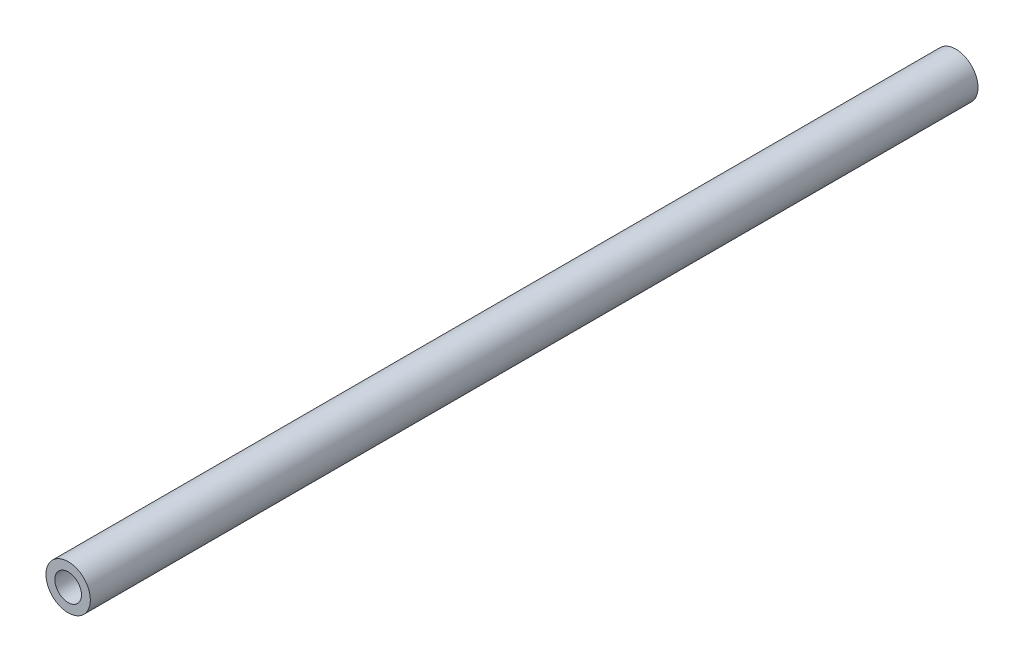
ISO-10303-21;
HEADER;
FILE_DESCRIPTION(('STEP AP214'),'2;1');
FILE_NAME('part.step','',(''),(''),'','','');
FILE_SCHEMA(('AUTOMOTIVE_DESIGN { 1 0 10303 214 1 1 1 1 }'));
ENDSEC;
DATA;
#1=APPLICATION_CONTEXT('core data for automotive mechanical design processes');
#2=APPLICATION_PROTOCOL_DEFINITION('international standard','automotive_design',2000,#1);
#3=PRODUCT_CONTEXT('',#1,'mechanical');
#4=PRODUCT('Part','Part','',(#3));
#5=PRODUCT_RELATED_PRODUCT_CATEGORY('part','',(#4));
#6=PRODUCT_DEFINITION_FORMATION('','',#4);
#7=PRODUCT_DEFINITION_CONTEXT('part definition',#1,'design');
#8=PRODUCT_DEFINITION('design','',#6,#7);
#9=PRODUCT_DEFINITION_SHAPE('','',#8);
#10=(LENGTH_UNIT() NAMED_UNIT(*) SI_UNIT(.MILLI.,.METRE.));
#11=(NAMED_UNIT(*) PLANE_ANGLE_UNIT() SI_UNIT($,.RADIAN.));
#12=(NAMED_UNIT(*) SI_UNIT($,.STERADIAN.) SOLID_ANGLE_UNIT());
#13=UNCERTAINTY_MEASURE_WITH_UNIT(LENGTH_MEASURE(1.E-05),#10,'distance_accuracy_value','');
#14=(GEOMETRIC_REPRESENTATION_CONTEXT(3) GLOBAL_UNCERTAINTY_ASSIGNED_CONTEXT((#13)) GLOBAL_UNIT_ASSIGNED_CONTEXT((#10,
#11,#12)) REPRESENTATION_CONTEXT('',''));
#15=CARTESIAN_POINT('',(0.,0.,0.));
#16=DIRECTION('',(0.,0.,1.));
#17=DIRECTION('',(1.,0.,0.));
#18=AXIS2_PLACEMENT_3D('',#15,#16,#17);
#19=CARTESIAN_POINT('',(0.,0.,300.));
#20=DIRECTION('',(0.,0.,1.));
#21=DIRECTION('',(1.,0.,0.));
#22=AXIS2_PLACEMENT_3D('',#19,#20,#21);
#23=PLANE('',#22);
#24=CARTESIAN_POINT('',(0.,0.,300.));
#25=DIRECTION('',(0.,0.,1.));
#26=DIRECTION('',(1.,0.,0.));
#27=AXIS2_PLACEMENT_3D('',#24,#25,#26);
#28=CIRCLE('',#27,7.5);
#29=CARTESIAN_POINT('',(7.5,0.,300.));
#30=VERTEX_POINT('',#29);
#31=EDGE_CURVE('E10',#30,#30,#28,.T.);
#32=ORIENTED_EDGE('',*,*,#31,.T.);
#33=EDGE_LOOP('',(#32));
#34=FACE_BOUND('',#33,.T.);
#35=CARTESIAN_POINT('',(0.,0.,300.));
#36=DIRECTION('',(0.,0.,1.));
#37=DIRECTION('',(1.,0.,0.));
#38=AXIS2_PLACEMENT_3D('',#35,#36,#37);
#39=CIRCLE('',#38,4.5);
#40=CARTESIAN_POINT('',(4.5,0.,300.));
#41=VERTEX_POINT('',#40);
#42=EDGE_CURVE('E42',#41,#41,#39,.T.);
#43=ORIENTED_EDGE('',*,*,#42,.F.);
#44=EDGE_LOOP('',(#43));
#45=FACE_BOUND('',#44,.T.);
#46=ADVANCED_FACE('F31',(#34,#45),#23,.T.);
#47=CARTESIAN_POINT('',(0.,0.,0.));
#48=DIRECTION('',(0.,0.,1.));
#49=DIRECTION('',(1.,0.,0.));
#50=AXIS2_PLACEMENT_3D('',#47,#48,#49);
#51=PLANE('',#50);
#52=CARTESIAN_POINT('',(0.,0.,0.));
#53=DIRECTION('',(0.,0.,1.));
#54=DIRECTION('',(1.,0.,0.));
#55=AXIS2_PLACEMENT_3D('',#52,#53,#54);
#56=CIRCLE('',#55,7.5);
#57=CARTESIAN_POINT('',(7.5,0.,0.));
#58=VERTEX_POINT('',#57);
#59=EDGE_CURVE('E35',#58,#58,#56,.T.);
#60=ORIENTED_EDGE('',*,*,#59,.F.);
#61=EDGE_LOOP('',(#60));
#62=FACE_BOUND('',#61,.T.);
#63=CARTESIAN_POINT('',(0.,0.,0.));
#64=DIRECTION('',(0.,0.,1.));
#65=DIRECTION('',(1.,0.,0.));
#66=AXIS2_PLACEMENT_3D('',#63,#64,#65);
#67=CIRCLE('',#66,4.5);
#68=CARTESIAN_POINT('',(4.5,0.,0.));
#69=VERTEX_POINT('',#68);
#70=EDGE_CURVE('E44',#69,#69,#67,.T.);
#71=ORIENTED_EDGE('',*,*,#70,.T.);
#72=EDGE_LOOP('',(#71));
#73=FACE_BOUND('',#72,.T.);
#74=ADVANCED_FACE('F54',(#62,#73),#51,.F.);
#75=CARTESIAN_POINT('',(0.,0.,300.));
#76=DIRECTION('',(0.,0.,-1.));
#77=DIRECTION('',(-1.,0.,0.));
#78=AXIS2_PLACEMENT_3D('',#75,#76,#77);
#79=CYLINDRICAL_SURFACE('',#78,7.5);
#80=ORIENTED_EDGE('',*,*,#31,.F.);
#81=EDGE_LOOP('',(#80));
#82=FACE_BOUND('',#81,.T.);
#83=ORIENTED_EDGE('',*,*,#59,.T.);
#84=EDGE_LOOP('',(#83));
#85=FACE_BOUND('',#84,.T.);
#86=ADVANCED_FACE('F33',(#82,#85),#79,.T.);
#87=CARTESIAN_POINT('',(0.,0.,300.));
#88=DIRECTION('',(0.,0.,-1.));
#89=DIRECTION('',(-1.,0.,0.));
#90=AXIS2_PLACEMENT_3D('',#87,#88,#89);
#91=CYLINDRICAL_SURFACE('',#90,4.5);
#92=ORIENTED_EDGE('',*,*,#42,.T.);
#93=EDGE_LOOP('',(#92));
#94=FACE_BOUND('',#93,.T.);
#95=ORIENTED_EDGE('',*,*,#70,.F.);
#96=EDGE_LOOP('',(#95));
#97=FACE_BOUND('',#96,.T.);
#98=ADVANCED_FACE('F50',(#94,#97),#91,.F.);
#99=CLOSED_SHELL('',(#46,#74,#86,#98));
#100=MANIFOLD_SOLID_BREP('B2',#99);
#101=ADVANCED_BREP_SHAPE_REPRESENTATION('',(#18,#100),#14);
#102=SHAPE_DEFINITION_REPRESENTATION(#9,#101);
ENDSEC;
END-ISO-10303-21;
